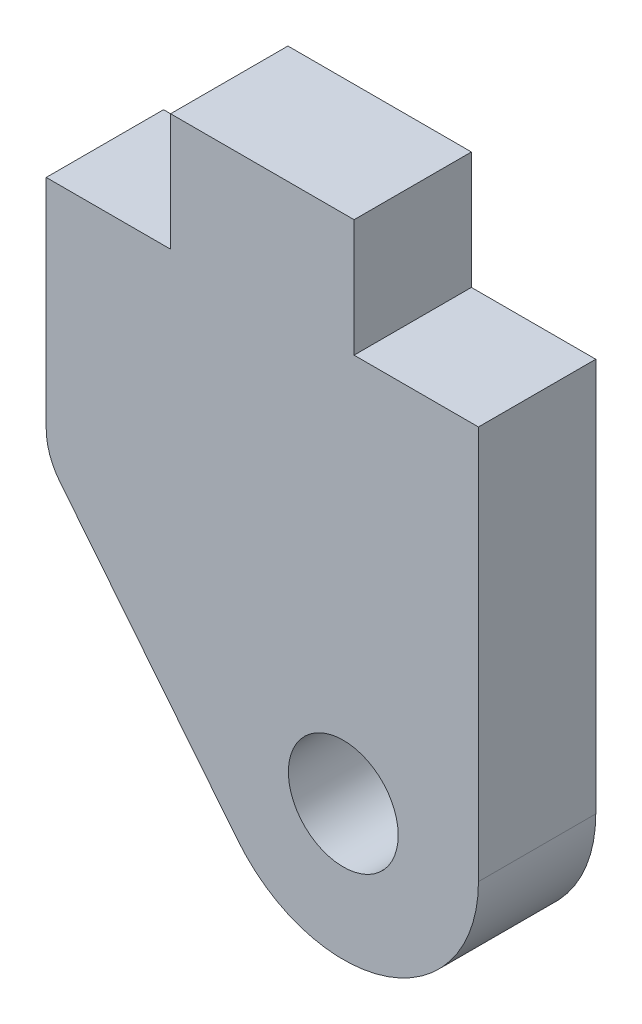
ISO-10303-21;
HEADER;
FILE_DESCRIPTION(('STEP AP214'),'2;1');
FILE_NAME('part.step','',(''),(''),'','','');
FILE_SCHEMA(('AUTOMOTIVE_DESIGN { 1 0 10303 214 1 1 1 1 }'));
ENDSEC;
DATA;
#1=APPLICATION_CONTEXT('core data for automotive mechanical design processes');
#2=APPLICATION_PROTOCOL_DEFINITION('international standard','automotive_design',2000,#1);
#3=PRODUCT_CONTEXT('',#1,'mechanical');
#4=PRODUCT('Part','Part','',(#3));
#5=PRODUCT_RELATED_PRODUCT_CATEGORY('part','',(#4));
#6=PRODUCT_DEFINITION_FORMATION('','',#4);
#7=PRODUCT_DEFINITION_CONTEXT('part definition',#1,'design');
#8=PRODUCT_DEFINITION('design','',#6,#7);
#9=PRODUCT_DEFINITION_SHAPE('','',#8);
#10=(LENGTH_UNIT() NAMED_UNIT(*) SI_UNIT(.MILLI.,.METRE.));
#11=(NAMED_UNIT(*) PLANE_ANGLE_UNIT() SI_UNIT($,.RADIAN.));
#12=(NAMED_UNIT(*) SI_UNIT($,.STERADIAN.) SOLID_ANGLE_UNIT());
#13=UNCERTAINTY_MEASURE_WITH_UNIT(LENGTH_MEASURE(1.E-05),#10,'distance_accuracy_value','');
#14=(GEOMETRIC_REPRESENTATION_CONTEXT(3) GLOBAL_UNCERTAINTY_ASSIGNED_CONTEXT((#13)) GLOBAL_UNIT_ASSIGNED_CONTEXT((#10,
#11,#12)) REPRESENTATION_CONTEXT('',''));
#15=CARTESIAN_POINT('',(0.,0.,0.));
#16=DIRECTION('',(0.,0.,1.));
#17=DIRECTION('',(1.,0.,0.));
#18=AXIS2_PLACEMENT_3D('',#15,#16,#17);
#19=CARTESIAN_POINT('',(-4.15925,-0.324042013838914,3.175));
#20=DIRECTION('',(0.,0.,1.));
#21=DIRECTION('',(1.,0.,0.));
#22=AXIS2_PLACEMENT_3D('',#19,#20,#21);
#23=PLANE('',#22);
#24=CARTESIAN_POINT('',(-4.15925,-0.324042013838914,3.175));
#25=DIRECTION('',(0.,0.,1.));
#26=DIRECTION('',(1.,0.,0.));
#27=AXIS2_PLACEMENT_3D('',#24,#25,#26);
#28=CIRCLE('',#27,1.6891);
#29=CARTESIAN_POINT('',(-5.84835,-0.324042013838908,3.175));
#30=VERTEX_POINT('',#29);
#31=CARTESIAN_POINT('',(-5.47615044218217,-1.38179058291401,3.175));
#32=VERTEX_POINT('',#31);
#33=EDGE_CURVE('E182',#30,#32,#28,.T.);
#34=ORIENTED_EDGE('',*,*,#33,.T.);
#35=DIRECTION('',(0.626220217319929,-0.779646227092635,0.));
#36=VECTOR('',#35,1.);
#37=CARTESIAN_POINT('',(-5.47615044218217,-1.38179058291401,3.175));
#38=LINE('',#37,#36);
#39=CARTESIAN_POINT('',(-0.660884040214026,-7.37681306686937,3.175));
#40=VERTEX_POINT('',#39);
#41=EDGE_CURVE('E106',#32,#40,#38,.T.);
#42=ORIENTED_EDGE('',*,*,#41,.T.);
#43=CARTESIAN_POINT('',(2.19075,-5.08635,3.175));
#44=DIRECTION('',(0.,0.,1.));
#45=DIRECTION('',(1.,0.,0.));
#46=AXIS2_PLACEMENT_3D('',#43,#44,#45);
#47=CIRCLE('',#46,3.6576);
#48=CARTESIAN_POINT('',(5.84835,-5.08635,3.175));
#49=VERTEX_POINT('',#48);
#50=EDGE_CURVE('E211',#40,#49,#47,.T.);
#51=ORIENTED_EDGE('',*,*,#50,.T.);
#52=DIRECTION('',(0.,1.,0.));
#53=VECTOR('',#52,1.);
#54=CARTESIAN_POINT('',(5.84835,-5.08635,3.175));
#55=LINE('',#54,#53);
#56=CARTESIAN_POINT('',(5.84835,5.56895,3.175));
#57=VERTEX_POINT('',#56);
#58=EDGE_CURVE('E231',#49,#57,#55,.T.);
#59=ORIENTED_EDGE('',*,*,#58,.T.);
#60=DIRECTION('',(-1.,0.,0.));
#61=VECTOR('',#60,1.);
#62=CARTESIAN_POINT('',(5.84835,5.56895,3.175));
#63=LINE('',#62,#61);
#64=CARTESIAN_POINT('',(2.48285,5.56895,3.175));
#65=VERTEX_POINT('',#64);
#66=EDGE_CURVE('E227',#57,#65,#63,.T.);
#67=ORIENTED_EDGE('',*,*,#66,.T.);
#68=DIRECTION('',(0.,1.,0.));
#69=VECTOR('',#68,1.);
#70=CARTESIAN_POINT('',(2.48285,5.56895,3.175));
#71=LINE('',#70,#69);
#72=CARTESIAN_POINT('',(2.48285,8.74395,3.175));
#73=VERTEX_POINT('',#72);
#74=EDGE_CURVE('E230',#65,#73,#71,.T.);
#75=ORIENTED_EDGE('',*,*,#74,.T.);
#76=DIRECTION('',(-1.,0.,0.));
#77=VECTOR('',#76,1.);
#78=CARTESIAN_POINT('',(2.48285,8.74395,3.175));
#79=LINE('',#78,#77);
#80=CARTESIAN_POINT('',(-2.48285,8.74395,3.175));
#81=VERTEX_POINT('',#80);
#82=EDGE_CURVE('E131',#73,#81,#79,.T.);
#83=ORIENTED_EDGE('',*,*,#82,.T.);
#84=DIRECTION('',(0.,-1.,0.));
#85=VECTOR('',#84,1.);
#86=CARTESIAN_POINT('',(-2.48285,8.74395,3.175));
#87=LINE('',#86,#85);
#88=CARTESIAN_POINT('',(-2.48285,5.56895,3.175));
#89=VERTEX_POINT('',#88);
#90=EDGE_CURVE('E125',#81,#89,#87,.T.);
#91=ORIENTED_EDGE('',*,*,#90,.T.);
#92=DIRECTION('',(-1.,0.,0.));
#93=VECTOR('',#92,1.);
#94=CARTESIAN_POINT('',(-2.48285,5.56895,3.175));
#95=LINE('',#94,#93);
#96=CARTESIAN_POINT('',(-5.84835,5.56895,3.175));
#97=VERTEX_POINT('',#96);
#98=EDGE_CURVE('E129',#89,#97,#95,.T.);
#99=ORIENTED_EDGE('',*,*,#98,.T.);
#100=DIRECTION('',(0.,-1.,0.));
#101=VECTOR('',#100,1.);
#102=CARTESIAN_POINT('',(-5.84835,5.56895,3.175));
#103=LINE('',#102,#101);
#104=EDGE_CURVE('E57',#97,#30,#103,.T.);
#105=ORIENTED_EDGE('',*,*,#104,.T.);
#106=EDGE_LOOP('',(#34,#42,#51,#59,#67,#75,#83,#91,#99,#105));
#107=FACE_BOUND('',#106,.T.);
#108=CARTESIAN_POINT('',(2.19075,-5.08635,3.175));
#109=DIRECTION('',(0.,0.,1.));
#110=DIRECTION('',(1.,0.,0.));
#111=AXIS2_PLACEMENT_3D('',#108,#109,#110);
#112=CIRCLE('',#111,1.4859);
#113=CARTESIAN_POINT('',(3.67665,-5.08635,3.175));
#114=VERTEX_POINT('',#113);
#115=EDGE_CURVE('E158',#114,#114,#112,.T.);
#116=ORIENTED_EDGE('',*,*,#115,.F.);
#117=EDGE_LOOP('',(#116));
#118=FACE_BOUND('',#117,.T.);
#119=ADVANCED_FACE('F39',(#107,#118),#23,.T.);
#120=CARTESIAN_POINT('',(-4.15925,-0.324042013838914,0.));
#121=DIRECTION('',(0.,0.,1.));
#122=DIRECTION('',(1.,0.,0.));
#123=AXIS2_PLACEMENT_3D('',#120,#121,#122);
#124=PLANE('',#123);
#125=CARTESIAN_POINT('',(-4.15925,-0.324042013838914,0.));
#126=DIRECTION('',(0.,0.,1.));
#127=DIRECTION('',(1.,0.,0.));
#128=AXIS2_PLACEMENT_3D('',#125,#126,#127);
#129=CIRCLE('',#128,1.6891);
#130=CARTESIAN_POINT('',(-5.84835,-0.324042013838908,0.));
#131=VERTEX_POINT('',#130);
#132=CARTESIAN_POINT('',(-5.47615044218217,-1.38179058291401,0.));
#133=VERTEX_POINT('',#132);
#134=EDGE_CURVE('E153',#131,#133,#129,.T.);
#135=ORIENTED_EDGE('',*,*,#134,.F.);
#136=DIRECTION('',(0.,-1.,0.));
#137=VECTOR('',#136,1.);
#138=CARTESIAN_POINT('',(-5.84835,5.56895,0.));
#139=LINE('',#138,#137);
#140=CARTESIAN_POINT('',(-5.84835,5.56895,0.));
#141=VERTEX_POINT('',#140);
#142=EDGE_CURVE('E98',#141,#131,#139,.T.);
#143=ORIENTED_EDGE('',*,*,#142,.F.);
#144=DIRECTION('',(-1.,0.,0.));
#145=VECTOR('',#144,1.);
#146=CARTESIAN_POINT('',(-2.48285,5.56895,0.));
#147=LINE('',#146,#145);
#148=CARTESIAN_POINT('',(-2.48285,5.56895,0.));
#149=VERTEX_POINT('',#148);
#150=EDGE_CURVE('E92',#149,#141,#147,.T.);
#151=ORIENTED_EDGE('',*,*,#150,.F.);
#152=DIRECTION('',(0.,-1.,0.));
#153=VECTOR('',#152,1.);
#154=CARTESIAN_POINT('',(-2.48285,8.74395,0.));
#155=LINE('',#154,#153);
#156=CARTESIAN_POINT('',(-2.48285,8.74395,0.));
#157=VERTEX_POINT('',#156);
#158=EDGE_CURVE('E140',#157,#149,#155,.T.);
#159=ORIENTED_EDGE('',*,*,#158,.F.);
#160=DIRECTION('',(-1.,0.,0.));
#161=VECTOR('',#160,1.);
#162=CARTESIAN_POINT('',(2.48285,8.74395,0.));
#163=LINE('',#162,#161);
#164=CARTESIAN_POINT('',(2.48285,8.74395,0.));
#165=VERTEX_POINT('',#164);
#166=EDGE_CURVE('E173',#165,#157,#163,.T.);
#167=ORIENTED_EDGE('',*,*,#166,.F.);
#168=DIRECTION('',(0.,1.,0.));
#169=VECTOR('',#168,1.);
#170=CARTESIAN_POINT('',(2.48285,5.56895,0.));
#171=LINE('',#170,#169);
#172=CARTESIAN_POINT('',(2.48285,5.56895,0.));
#173=VERTEX_POINT('',#172);
#174=EDGE_CURVE('E170',#173,#165,#171,.T.);
#175=ORIENTED_EDGE('',*,*,#174,.F.);
#176=DIRECTION('',(-1.,0.,0.));
#177=VECTOR('',#176,1.);
#178=CARTESIAN_POINT('',(5.84835,5.56895,0.));
#179=LINE('',#178,#177);
#180=CARTESIAN_POINT('',(5.84835,5.56895,0.));
#181=VERTEX_POINT('',#180);
#182=EDGE_CURVE('E167',#181,#173,#179,.T.);
#183=ORIENTED_EDGE('',*,*,#182,.F.);
#184=DIRECTION('',(0.,1.,0.));
#185=VECTOR('',#184,1.);
#186=CARTESIAN_POINT('',(5.84835,-5.08635,0.));
#187=LINE('',#186,#185);
#188=CARTESIAN_POINT('',(5.84835,-5.08635,0.));
#189=VERTEX_POINT('',#188);
#190=EDGE_CURVE('E164',#189,#181,#187,.T.);
#191=ORIENTED_EDGE('',*,*,#190,.F.);
#192=CARTESIAN_POINT('',(2.19075,-5.08635,0.));
#193=DIRECTION('',(0.,0.,1.));
#194=DIRECTION('',(1.,0.,0.));
#195=AXIS2_PLACEMENT_3D('',#192,#193,#194);
#196=CIRCLE('',#195,3.6576);
#197=CARTESIAN_POINT('',(-0.660884040214026,-7.37681306686937,0.));
#198=VERTEX_POINT('',#197);
#199=EDGE_CURVE('E161',#198,#189,#196,.T.);
#200=ORIENTED_EDGE('',*,*,#199,.F.);
#201=DIRECTION('',(0.626220217319929,-0.779646227092635,0.));
#202=VECTOR('',#201,1.);
#203=CARTESIAN_POINT('',(-5.47615044218217,-1.38179058291401,0.));
#204=LINE('',#203,#202);
#205=EDGE_CURVE('E157',#133,#198,#204,.T.);
#206=ORIENTED_EDGE('',*,*,#205,.F.);
#207=EDGE_LOOP('',(#135,#143,#151,#159,#167,#175,#183,#191,#200,#206));
#208=FACE_BOUND('',#207,.T.);
#209=CARTESIAN_POINT('',(2.19075,-5.08635,0.));
#210=DIRECTION('',(0.,0.,1.));
#211=DIRECTION('',(1.,0.,0.));
#212=AXIS2_PLACEMENT_3D('',#209,#210,#211);
#213=CIRCLE('',#212,1.4859);
#214=CARTESIAN_POINT('',(3.67665,-5.08635,0.));
#215=VERTEX_POINT('',#214);
#216=EDGE_CURVE('E245',#215,#215,#213,.T.);
#217=ORIENTED_EDGE('',*,*,#216,.T.);
#218=EDGE_LOOP('',(#217));
#219=FACE_BOUND('',#218,.T.);
#220=ADVANCED_FACE('F215',(#208,#219),#124,.F.);
#221=CARTESIAN_POINT('',(-4.15925,-0.324042013838914,3.175));
#222=DIRECTION('',(0.,0.,-1.));
#223=DIRECTION('',(-1.,0.,0.));
#224=AXIS2_PLACEMENT_3D('',#221,#222,#223);
#225=CYLINDRICAL_SURFACE('',#224,1.6891);
#226=ORIENTED_EDGE('',*,*,#134,.T.);
#227=DIRECTION('',(0.,0.,-1.));
#228=VECTOR('',#227,1.);
#229=CARTESIAN_POINT('',(-5.47615044218217,-1.38179058291401,3.175));
#230=LINE('',#229,#228);
#231=EDGE_CURVE('E11',#32,#133,#230,.T.);
#232=ORIENTED_EDGE('',*,*,#231,.F.);
#233=ORIENTED_EDGE('',*,*,#33,.F.);
#234=DIRECTION('',(0.,0.,-1.));
#235=VECTOR('',#234,1.);
#236=CARTESIAN_POINT('',(-5.84835,-0.324042013838908,3.175));
#237=LINE('',#236,#235);
#238=EDGE_CURVE('E149',#30,#131,#237,.T.);
#239=ORIENTED_EDGE('',*,*,#238,.T.);
#240=EDGE_LOOP('',(#226,#232,#233,#239));
#241=FACE_BOUND('',#240,.T.);
#242=ADVANCED_FACE('F41',(#241),#225,.T.);
#243=CARTESIAN_POINT('',(-5.47615044218217,-1.38179058291401,3.175));
#244=DIRECTION('',(0.779646227092635,0.626220217319929,0.));
#245=DIRECTION('',(-0.626220217319929,0.779646227092635,0.));
#246=AXIS2_PLACEMENT_3D('',#243,#244,#245);
#247=PLANE('',#246);
#248=ORIENTED_EDGE('',*,*,#205,.T.);
#249=DIRECTION('',(0.,0.,-1.));
#250=VECTOR('',#249,1.);
#251=CARTESIAN_POINT('',(-0.660884040214026,-7.37681306686937,3.175));
#252=LINE('',#251,#250);
#253=EDGE_CURVE('E49',#40,#198,#252,.T.);
#254=ORIENTED_EDGE('',*,*,#253,.F.);
#255=ORIENTED_EDGE('',*,*,#41,.F.);
#256=ORIENTED_EDGE('',*,*,#231,.T.);
#257=EDGE_LOOP('',(#248,#254,#255,#256));
#258=FACE_BOUND('',#257,.T.);
#259=ADVANCED_FACE('F283',(#258),#247,.F.);
#260=CARTESIAN_POINT('',(2.19075,-5.08635,3.175));
#261=DIRECTION('',(0.,0.,-1.));
#262=DIRECTION('',(-1.,0.,0.));
#263=AXIS2_PLACEMENT_3D('',#260,#261,#262);
#264=CYLINDRICAL_SURFACE('',#263,3.6576);
#265=ORIENTED_EDGE('',*,*,#199,.T.);
#266=DIRECTION('',(0.,0.,-1.));
#267=VECTOR('',#266,1.);
#268=CARTESIAN_POINT('',(5.84835,-5.08635,3.175));
#269=LINE('',#268,#267);
#270=EDGE_CURVE('E201',#49,#189,#269,.T.);
#271=ORIENTED_EDGE('',*,*,#270,.F.);
#272=ORIENTED_EDGE('',*,*,#50,.F.);
#273=ORIENTED_EDGE('',*,*,#253,.T.);
#274=EDGE_LOOP('',(#265,#271,#272,#273));
#275=FACE_BOUND('',#274,.T.);
#276=ADVANCED_FACE('F209',(#275),#264,.T.);
#277=CARTESIAN_POINT('',(5.84835,-5.08635,3.175));
#278=DIRECTION('',(-1.,0.,0.));
#279=DIRECTION('',(0.,-1.,0.));
#280=AXIS2_PLACEMENT_3D('',#277,#278,#279);
#281=PLANE('',#280);
#282=ORIENTED_EDGE('',*,*,#190,.T.);
#283=DIRECTION('',(0.,0.,-1.));
#284=VECTOR('',#283,1.);
#285=CARTESIAN_POINT('',(5.84835,5.56895,3.175));
#286=LINE('',#285,#284);
#287=EDGE_CURVE('E197',#57,#181,#286,.T.);
#288=ORIENTED_EDGE('',*,*,#287,.F.);
#289=ORIENTED_EDGE('',*,*,#58,.F.);
#290=ORIENTED_EDGE('',*,*,#270,.T.);
#291=EDGE_LOOP('',(#282,#288,#289,#290));
#292=FACE_BOUND('',#291,.T.);
#293=ADVANCED_FACE('F221',(#292),#281,.F.);
#294=CARTESIAN_POINT('',(5.84835,5.56895,3.175));
#295=DIRECTION('',(0.,-1.,0.));
#296=DIRECTION('',(0.,0.,-1.));
#297=AXIS2_PLACEMENT_3D('',#294,#295,#296);
#298=PLANE('',#297);
#299=ORIENTED_EDGE('',*,*,#182,.T.);
#300=DIRECTION('',(0.,0.,-1.));
#301=VECTOR('',#300,1.);
#302=CARTESIAN_POINT('',(2.48285,5.56895,3.175));
#303=LINE('',#302,#301);
#304=EDGE_CURVE('E193',#65,#173,#303,.T.);
#305=ORIENTED_EDGE('',*,*,#304,.F.);
#306=ORIENTED_EDGE('',*,*,#66,.F.);
#307=ORIENTED_EDGE('',*,*,#287,.T.);
#308=EDGE_LOOP('',(#299,#305,#306,#307));
#309=FACE_BOUND('',#308,.T.);
#310=ADVANCED_FACE('F225',(#309),#298,.F.);
#311=CARTESIAN_POINT('',(2.48285,5.56895,3.175));
#312=DIRECTION('',(-1.,0.,0.));
#313=DIRECTION('',(0.,0.,1.));
#314=AXIS2_PLACEMENT_3D('',#311,#312,#313);
#315=PLANE('',#314);
#316=ORIENTED_EDGE('',*,*,#174,.T.);
#317=DIRECTION('',(0.,0.,-1.));
#318=VECTOR('',#317,1.);
#319=CARTESIAN_POINT('',(2.48285,8.74395,3.175));
#320=LINE('',#319,#318);
#321=EDGE_CURVE('E189',#73,#165,#320,.T.);
#322=ORIENTED_EDGE('',*,*,#321,.F.);
#323=ORIENTED_EDGE('',*,*,#74,.F.);
#324=ORIENTED_EDGE('',*,*,#304,.T.);
#325=EDGE_LOOP('',(#316,#322,#323,#324));
#326=FACE_BOUND('',#325,.T.);
#327=ADVANCED_FACE('F273',(#326),#315,.F.);
#328=CARTESIAN_POINT('',(2.48285,8.74395,3.175));
#329=DIRECTION('',(0.,-1.,0.));
#330=DIRECTION('',(0.,0.,-1.));
#331=AXIS2_PLACEMENT_3D('',#328,#329,#330);
#332=PLANE('',#331);
#333=ORIENTED_EDGE('',*,*,#166,.T.);
#334=DIRECTION('',(0.,0.,-1.));
#335=VECTOR('',#334,1.);
#336=CARTESIAN_POINT('',(-2.48285,8.74395,3.175));
#337=LINE('',#336,#335);
#338=EDGE_CURVE('E142',#81,#157,#337,.T.);
#339=ORIENTED_EDGE('',*,*,#338,.F.);
#340=ORIENTED_EDGE('',*,*,#82,.F.);
#341=ORIENTED_EDGE('',*,*,#321,.T.);
#342=EDGE_LOOP('',(#333,#339,#340,#341));
#343=FACE_BOUND('',#342,.T.);
#344=ADVANCED_FACE('F270',(#343),#332,.F.);
#345=CARTESIAN_POINT('',(-2.48285,8.74395,3.175));
#346=DIRECTION('',(1.,0.,0.));
#347=DIRECTION('',(0.,0.,-1.));
#348=AXIS2_PLACEMENT_3D('',#345,#346,#347);
#349=PLANE('',#348);
#350=ORIENTED_EDGE('',*,*,#158,.T.);
#351=DIRECTION('',(0.,0.,-1.));
#352=VECTOR('',#351,1.);
#353=CARTESIAN_POINT('',(-2.48285,5.56895,3.175));
#354=LINE('',#353,#352);
#355=EDGE_CURVE('E137',#89,#149,#354,.T.);
#356=ORIENTED_EDGE('',*,*,#355,.F.);
#357=ORIENTED_EDGE('',*,*,#90,.F.);
#358=ORIENTED_EDGE('',*,*,#338,.T.);
#359=EDGE_LOOP('',(#350,#356,#357,#358));
#360=FACE_BOUND('',#359,.T.);
#361=ADVANCED_FACE('F138',(#360),#349,.F.);
#362=CARTESIAN_POINT('',(-2.48285,5.56895,3.175));
#363=DIRECTION('',(0.,-1.,0.));
#364=DIRECTION('',(0.,0.,-1.));
#365=AXIS2_PLACEMENT_3D('',#362,#363,#364);
#366=PLANE('',#365);
#367=ORIENTED_EDGE('',*,*,#150,.T.);
#368=DIRECTION('',(0.,0.,-1.));
#369=VECTOR('',#368,1.);
#370=CARTESIAN_POINT('',(-5.84835,5.56895,3.175));
#371=LINE('',#370,#369);
#372=EDGE_CURVE('E143',#97,#141,#371,.T.);
#373=ORIENTED_EDGE('',*,*,#372,.F.);
#374=ORIENTED_EDGE('',*,*,#98,.F.);
#375=ORIENTED_EDGE('',*,*,#355,.T.);
#376=EDGE_LOOP('',(#367,#373,#374,#375));
#377=FACE_BOUND('',#376,.T.);
#378=ADVANCED_FACE('F145',(#377),#366,.F.);
#379=CARTESIAN_POINT('',(-5.84835,5.56895,3.175));
#380=DIRECTION('',(1.,0.,0.));
#381=DIRECTION('',(0.,1.,0.));
#382=AXIS2_PLACEMENT_3D('',#379,#380,#381);
#383=PLANE('',#382);
#384=ORIENTED_EDGE('',*,*,#142,.T.);
#385=ORIENTED_EDGE('',*,*,#238,.F.);
#386=ORIENTED_EDGE('',*,*,#104,.F.);
#387=ORIENTED_EDGE('',*,*,#372,.T.);
#388=EDGE_LOOP('',(#384,#385,#386,#387));
#389=FACE_BOUND('',#388,.T.);
#390=ADVANCED_FACE('F263',(#389),#383,.F.);
#391=CARTESIAN_POINT('',(2.19075,-5.08635,3.175));
#392=DIRECTION('',(0.,0.,-1.));
#393=DIRECTION('',(-1.,0.,0.));
#394=AXIS2_PLACEMENT_3D('',#391,#392,#393);
#395=CYLINDRICAL_SURFACE('',#394,1.4859);
#396=ORIENTED_EDGE('',*,*,#115,.T.);
#397=EDGE_LOOP('',(#396));
#398=FACE_BOUND('',#397,.T.);
#399=ORIENTED_EDGE('',*,*,#216,.F.);
#400=EDGE_LOOP('',(#399));
#401=FACE_BOUND('',#400,.T.);
#402=ADVANCED_FACE('F253',(#398,#401),#395,.F.);
#403=CLOSED_SHELL('',(#119,#220,#242,#259,#276,#293,#310,#327,#344,#361,#378,#390,#402));
#404=MANIFOLD_SOLID_BREP('B2',#403);
#405=ADVANCED_BREP_SHAPE_REPRESENTATION('',(#18,#404),#14);
#406=SHAPE_DEFINITION_REPRESENTATION(#9,#405);
ENDSEC;
END-ISO-10303-21;
